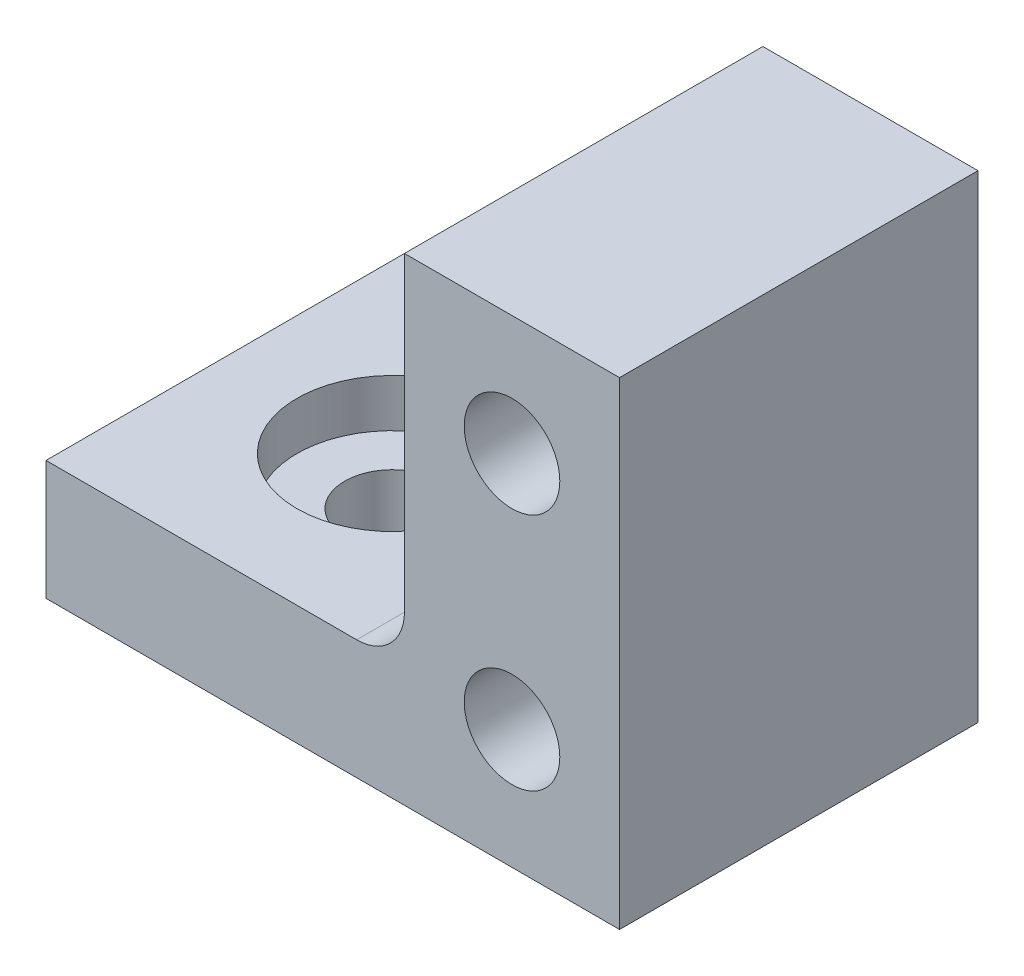
ISO-10303-21;
HEADER;
FILE_DESCRIPTION(('STEP AP214'),'2;1');
FILE_NAME('part.step','',(''),(''),'','','');
FILE_SCHEMA(('AUTOMOTIVE_DESIGN { 1 0 10303 214 1 1 1 1 }'));
ENDSEC;
DATA;
#1=APPLICATION_CONTEXT('core data for automotive mechanical design processes');
#2=APPLICATION_PROTOCOL_DEFINITION('international standard','automotive_design',2000,#1);
#3=PRODUCT_CONTEXT('',#1,'mechanical');
#4=PRODUCT('Part','Part','',(#3));
#5=PRODUCT_RELATED_PRODUCT_CATEGORY('part','',(#4));
#6=PRODUCT_DEFINITION_FORMATION('','',#4);
#7=PRODUCT_DEFINITION_CONTEXT('part definition',#1,'design');
#8=PRODUCT_DEFINITION('design','',#6,#7);
#9=PRODUCT_DEFINITION_SHAPE('','',#8);
#10=(LENGTH_UNIT() NAMED_UNIT(*) SI_UNIT(.MILLI.,.METRE.));
#11=(NAMED_UNIT(*) PLANE_ANGLE_UNIT() SI_UNIT($,.RADIAN.));
#12=(NAMED_UNIT(*) SI_UNIT($,.STERADIAN.) SOLID_ANGLE_UNIT());
#13=UNCERTAINTY_MEASURE_WITH_UNIT(LENGTH_MEASURE(1.E-05),#10,'distance_accuracy_value','');
#14=(GEOMETRIC_REPRESENTATION_CONTEXT(3) GLOBAL_UNCERTAINTY_ASSIGNED_CONTEXT((#13)) GLOBAL_UNIT_ASSIGNED_CONTEXT((#10,
#11,#12)) REPRESENTATION_CONTEXT('',''));
#15=CARTESIAN_POINT('',(0.,0.,0.));
#16=DIRECTION('',(0.,0.,1.));
#17=DIRECTION('',(1.,0.,0.));
#18=AXIS2_PLACEMENT_3D('',#15,#16,#17);
#19=CARTESIAN_POINT('',(-5.,-0.00100000000000013,0.));
#20=DIRECTION('',(0.,1.,0.));
#21=DIRECTION('',(0.,0.,1.));
#22=AXIS2_PLACEMENT_3D('',#19,#20,#21);
#23=CYLINDRICAL_SURFACE('',#22,2.);
#24=CARTESIAN_POINT('',(-5.,0.,0.));
#25=DIRECTION('',(0.,1.,0.));
#26=DIRECTION('',(0.,0.,1.));
#27=AXIS2_PLACEMENT_3D('',#24,#25,#26);
#28=CIRCLE('',#27,2.);
#29=CARTESIAN_POINT('',(-5.,0.,2.));
#30=VERTEX_POINT('',#29);
#31=EDGE_CURVE('E120',#30,#30,#28,.F.);
#32=ORIENTED_EDGE('',*,*,#31,.T.);
#33=EDGE_LOOP('',(#32));
#34=FACE_BOUND('',#33,.T.);
#35=CARTESIAN_POINT('',(-5.,3.,0.));
#36=DIRECTION('',(0.,1.,0.));
#37=DIRECTION('',(0.,0.,1.));
#38=AXIS2_PLACEMENT_3D('',#35,#36,#37);
#39=CIRCLE('',#38,2.);
#40=CARTESIAN_POINT('',(-5.,3.,2.));
#41=VERTEX_POINT('',#40);
#42=EDGE_CURVE('E123',#41,#41,#39,.F.);
#43=ORIENTED_EDGE('',*,*,#42,.F.);
#44=EDGE_LOOP('',(#43));
#45=FACE_BOUND('',#44,.T.);
#46=ADVANCED_FACE('F36',(#34,#45),#23,.F.);
#47=CARTESIAN_POINT('',(-12.,5.,-7.5));
#48=DIRECTION('',(1.,0.,0.));
#49=DIRECTION('',(0.,0.,-1.));
#50=AXIS2_PLACEMENT_3D('',#47,#48,#49);
#51=PLANE('',#50);
#52=DIRECTION('',(0.,0.,1.));
#53=VECTOR('',#52,1.);
#54=CARTESIAN_POINT('',(-12.,0.,-7.5));
#55=LINE('',#54,#53);
#56=CARTESIAN_POINT('',(-12.,0.,-7.5));
#57=VERTEX_POINT('',#56);
#58=CARTESIAN_POINT('',(-12.,0.,7.5));
#59=VERTEX_POINT('',#58);
#60=EDGE_CURVE('E132',#57,#59,#55,.T.);
#61=ORIENTED_EDGE('',*,*,#60,.T.);
#62=DIRECTION('',(0.,-1.,0.));
#63=VECTOR('',#62,1.);
#64=CARTESIAN_POINT('',(-12.,5.,7.5));
#65=LINE('',#64,#63);
#66=CARTESIAN_POINT('',(-12.,5.,7.5));
#67=VERTEX_POINT('',#66);
#68=EDGE_CURVE('E150',#67,#59,#65,.T.);
#69=ORIENTED_EDGE('',*,*,#68,.F.);
#70=DIRECTION('',(0.,0.,1.));
#71=VECTOR('',#70,1.);
#72=CARTESIAN_POINT('',(-12.,5.,-7.5));
#73=LINE('',#72,#71);
#74=CARTESIAN_POINT('',(-12.,5.,-7.5));
#75=VERTEX_POINT('',#74);
#76=EDGE_CURVE('E133',#75,#67,#73,.T.);
#77=ORIENTED_EDGE('',*,*,#76,.F.);
#78=DIRECTION('',(0.,-1.,0.));
#79=VECTOR('',#78,1.);
#80=CARTESIAN_POINT('',(-12.,5.,-7.5));
#81=LINE('',#80,#79);
#82=EDGE_CURVE('E105',#75,#57,#81,.T.);
#83=ORIENTED_EDGE('',*,*,#82,.T.);
#84=EDGE_LOOP('',(#61,#69,#77,#83));
#85=FACE_BOUND('',#84,.T.);
#86=ADVANCED_FACE('F172',(#85),#51,.F.);
#87=CARTESIAN_POINT('',(-12.,5.,7.5));
#88=DIRECTION('',(0.,0.,-1.));
#89=DIRECTION('',(-1.,0.,0.));
#90=AXIS2_PLACEMENT_3D('',#87,#88,#89);
#91=PLANE('',#90);
#92=CARTESIAN_POINT('',(7.5,15.,7.5));
#93=DIRECTION('',(0.,0.,1.));
#94=DIRECTION('',(1.,0.,0.));
#95=AXIS2_PLACEMENT_3D('',#92,#93,#94);
#96=CIRCLE('',#95,2.);
#97=CARTESIAN_POINT('',(9.5,15.,7.5));
#98=VERTEX_POINT('',#97);
#99=EDGE_CURVE('E311',#98,#98,#96,.T.);
#100=ORIENTED_EDGE('',*,*,#99,.F.);
#101=EDGE_LOOP('',(#100));
#102=FACE_BOUND('',#101,.T.);
#103=CARTESIAN_POINT('',(7.5,5.,7.5));
#104=DIRECTION('',(0.,0.,1.));
#105=DIRECTION('',(1.,0.,0.));
#106=AXIS2_PLACEMENT_3D('',#103,#104,#105);
#107=CIRCLE('',#106,2.);
#108=CARTESIAN_POINT('',(9.5,5.,7.5));
#109=VERTEX_POINT('',#108);
#110=EDGE_CURVE('E314',#109,#109,#107,.T.);
#111=ORIENTED_EDGE('',*,*,#110,.F.);
#112=EDGE_LOOP('',(#111));
#113=FACE_BOUND('',#112,.T.);
#114=DIRECTION('',(1.,0.,0.));
#115=VECTOR('',#114,1.);
#116=CARTESIAN_POINT('',(-12.,0.,7.5));
#117=LINE('',#116,#115);
#118=CARTESIAN_POINT('',(12.,0.,7.5));
#119=VERTEX_POINT('',#118);
#120=EDGE_CURVE('E143',#59,#119,#117,.T.);
#121=ORIENTED_EDGE('',*,*,#120,.T.);
#122=DIRECTION('',(0.,-1.,0.));
#123=VECTOR('',#122,1.);
#124=CARTESIAN_POINT('',(12.,5.,7.5));
#125=LINE('',#124,#123);
#126=CARTESIAN_POINT('',(12.,20.,7.5));
#127=VERTEX_POINT('',#126);
#128=EDGE_CURVE('E104',#127,#119,#125,.T.);
#129=ORIENTED_EDGE('',*,*,#128,.F.);
#130=DIRECTION('',(1.,0.,0.));
#131=VECTOR('',#130,1.);
#132=CARTESIAN_POINT('',(3.,20.,7.5));
#133=LINE('',#132,#131);
#134=CARTESIAN_POINT('',(3.,20.,7.5));
#135=VERTEX_POINT('',#134);
#136=EDGE_CURVE('E119',#135,#127,#133,.T.);
#137=ORIENTED_EDGE('',*,*,#136,.F.);
#138=DIRECTION('',(0.,-1.,0.));
#139=VECTOR('',#138,1.);
#140=CARTESIAN_POINT('',(3.,20.,7.5));
#141=LINE('',#140,#139);
#142=CARTESIAN_POINT('',(3.,7.,7.5));
#143=VERTEX_POINT('',#142);
#144=EDGE_CURVE('E129',#135,#143,#141,.T.);
#145=ORIENTED_EDGE('',*,*,#144,.T.);
#146=CARTESIAN_POINT('',(1.,7.,7.5));
#147=DIRECTION('',(0.,0.,-1.));
#148=DIRECTION('',(-1.,0.,0.));
#149=AXIS2_PLACEMENT_3D('',#146,#147,#148);
#150=CIRCLE('',#149,2.);
#151=CARTESIAN_POINT('',(1.,5.,7.5));
#152=VERTEX_POINT('',#151);
#153=EDGE_CURVE('E44',#143,#152,#150,.T.);
#154=ORIENTED_EDGE('',*,*,#153,.T.);
#155=DIRECTION('',(1.,0.,0.));
#156=VECTOR('',#155,1.);
#157=CARTESIAN_POINT('',(-12.,5.,7.5));
#158=LINE('',#157,#156);
#159=EDGE_CURVE('E136',#67,#152,#158,.T.);
#160=ORIENTED_EDGE('',*,*,#159,.F.);
#161=ORIENTED_EDGE('',*,*,#68,.T.);
#162=EDGE_LOOP('',(#121,#129,#137,#145,#154,#160,#161));
#163=FACE_BOUND('',#162,.T.);
#164=ADVANCED_FACE('F165',(#102,#113,#163),#91,.F.);
#165=CARTESIAN_POINT('',(12.,5.,-7.5));
#166=DIRECTION('',(1.,0.,0.));
#167=DIRECTION('',(0.,0.,-1.));
#168=AXIS2_PLACEMENT_3D('',#165,#166,#167);
#169=PLANE('',#168);
#170=DIRECTION('',(0.,0.,1.));
#171=VECTOR('',#170,1.);
#172=CARTESIAN_POINT('',(12.,0.,-7.5));
#173=LINE('',#172,#171);
#174=CARTESIAN_POINT('',(12.,0.,-7.5));
#175=VERTEX_POINT('',#174);
#176=EDGE_CURVE('E100',#175,#119,#173,.T.);
#177=ORIENTED_EDGE('',*,*,#176,.F.);
#178=DIRECTION('',(0.,-1.,0.));
#179=VECTOR('',#178,1.);
#180=CARTESIAN_POINT('',(12.,5.,-7.5));
#181=LINE('',#180,#179);
#182=CARTESIAN_POINT('',(12.,20.,-7.5));
#183=VERTEX_POINT('',#182);
#184=EDGE_CURVE('E94',#183,#175,#181,.T.);
#185=ORIENTED_EDGE('',*,*,#184,.F.);
#186=DIRECTION('',(0.,0.,-1.));
#187=VECTOR('',#186,1.);
#188=CARTESIAN_POINT('',(12.,20.,7.5));
#189=LINE('',#188,#187);
#190=EDGE_CURVE('E98',#127,#183,#189,.T.);
#191=ORIENTED_EDGE('',*,*,#190,.F.);
#192=ORIENTED_EDGE('',*,*,#128,.T.);
#193=EDGE_LOOP('',(#177,#185,#191,#192));
#194=FACE_BOUND('',#193,.T.);
#195=ADVANCED_FACE('F96',(#194),#169,.T.);
#196=CARTESIAN_POINT('',(-12.,5.,-7.5));
#197=DIRECTION('',(0.,0.,-1.));
#198=DIRECTION('',(-1.,0.,0.));
#199=AXIS2_PLACEMENT_3D('',#196,#197,#198);
#200=PLANE('',#199);
#201=CARTESIAN_POINT('',(7.5,15.,-7.5));
#202=DIRECTION('',(0.,0.,-1.));
#203=DIRECTION('',(-1.,0.,0.));
#204=AXIS2_PLACEMENT_3D('',#201,#202,#203);
#205=CIRCLE('',#204,2.);
#206=CARTESIAN_POINT('',(5.5,15.,-7.5));
#207=VERTEX_POINT('',#206);
#208=EDGE_CURVE('E319',#207,#207,#205,.F.);
#209=ORIENTED_EDGE('',*,*,#208,.T.);
#210=EDGE_LOOP('',(#209));
#211=FACE_BOUND('',#210,.T.);
#212=CARTESIAN_POINT('',(7.5,5.,-7.5));
#213=DIRECTION('',(0.,0.,-1.));
#214=DIRECTION('',(-1.,0.,0.));
#215=AXIS2_PLACEMENT_3D('',#212,#213,#214);
#216=CIRCLE('',#215,2.);
#217=CARTESIAN_POINT('',(5.5,5.,-7.5));
#218=VERTEX_POINT('',#217);
#219=EDGE_CURVE('E316',#218,#218,#216,.F.);
#220=ORIENTED_EDGE('',*,*,#219,.T.);
#221=EDGE_LOOP('',(#220));
#222=FACE_BOUND('',#221,.T.);
#223=DIRECTION('',(1.,0.,0.));
#224=VECTOR('',#223,1.);
#225=CARTESIAN_POINT('',(-12.,0.,-7.5));
#226=LINE('',#225,#224);
#227=EDGE_CURVE('E137',#57,#175,#226,.T.);
#228=ORIENTED_EDGE('',*,*,#227,.F.);
#229=ORIENTED_EDGE('',*,*,#82,.F.);
#230=DIRECTION('',(1.,0.,0.));
#231=VECTOR('',#230,1.);
#232=CARTESIAN_POINT('',(-12.,5.,-7.5));
#233=LINE('',#232,#231);
#234=CARTESIAN_POINT('',(0.999999999999999,5.,-7.5));
#235=VERTEX_POINT('',#234);
#236=EDGE_CURVE('E139',#75,#235,#233,.T.);
#237=ORIENTED_EDGE('',*,*,#236,.T.);
#238=CARTESIAN_POINT('',(0.999999999999999,7.,-7.5));
#239=DIRECTION('',(0.,0.,-1.));
#240=DIRECTION('',(-1.,0.,0.));
#241=AXIS2_PLACEMENT_3D('',#238,#239,#240);
#242=CIRCLE('',#241,2.);
#243=CARTESIAN_POINT('',(3.,7.,-7.5));
#244=VERTEX_POINT('',#243);
#245=EDGE_CURVE('E11',#235,#244,#242,.F.);
#246=ORIENTED_EDGE('',*,*,#245,.T.);
#247=DIRECTION('',(0.,-1.,0.));
#248=VECTOR('',#247,1.);
#249=CARTESIAN_POINT('',(3.,20.,-7.5));
#250=LINE('',#249,#248);
#251=CARTESIAN_POINT('',(3.,20.,-7.5));
#252=VERTEX_POINT('',#251);
#253=EDGE_CURVE('E111',#252,#244,#250,.T.);
#254=ORIENTED_EDGE('',*,*,#253,.F.);
#255=DIRECTION('',(-1.,0.,0.));
#256=VECTOR('',#255,1.);
#257=CARTESIAN_POINT('',(12.,20.,-7.5));
#258=LINE('',#257,#256);
#259=EDGE_CURVE('E108',#183,#252,#258,.T.);
#260=ORIENTED_EDGE('',*,*,#259,.F.);
#261=ORIENTED_EDGE('',*,*,#184,.T.);
#262=EDGE_LOOP('',(#228,#229,#237,#246,#254,#260,#261));
#263=FACE_BOUND('',#262,.T.);
#264=ADVANCED_FACE('F109',(#211,#222,#263),#200,.T.);
#265=CARTESIAN_POINT('',(0.,5.,0.));
#266=DIRECTION('',(0.,1.,0.));
#267=DIRECTION('',(0.,0.,1.));
#268=AXIS2_PLACEMENT_3D('',#265,#266,#267);
#269=PLANE('',#268);
#270=CARTESIAN_POINT('',(-5.,5.,0.));
#271=DIRECTION('',(0.,1.,0.));
#272=DIRECTION('',(0.,0.,1.));
#273=AXIS2_PLACEMENT_3D('',#270,#271,#272);
#274=CIRCLE('',#273,4.);
#275=CARTESIAN_POINT('',(-5.,5.,4.));
#276=VERTEX_POINT('',#275);
#277=EDGE_CURVE('E324',#276,#276,#274,.T.);
#278=ORIENTED_EDGE('',*,*,#277,.F.);
#279=EDGE_LOOP('',(#278));
#280=FACE_BOUND('',#279,.T.);
#281=ORIENTED_EDGE('',*,*,#159,.T.);
#282=DIRECTION('',(0.,0.,1.));
#283=VECTOR('',#282,1.);
#284=CARTESIAN_POINT('',(1.,5.,0.));
#285=LINE('',#284,#283);
#286=EDGE_CURVE('E57',#152,#235,#285,.F.);
#287=ORIENTED_EDGE('',*,*,#286,.T.);
#288=ORIENTED_EDGE('',*,*,#236,.F.);
#289=ORIENTED_EDGE('',*,*,#76,.T.);
#290=EDGE_LOOP('',(#281,#287,#288,#289));
#291=FACE_BOUND('',#290,.T.);
#292=ADVANCED_FACE('F173',(#280,#291),#269,.T.);
#293=CARTESIAN_POINT('',(0.,0.,0.));
#294=DIRECTION('',(0.,1.,0.));
#295=DIRECTION('',(0.,0.,1.));
#296=AXIS2_PLACEMENT_3D('',#293,#294,#295);
#297=PLANE('',#296);
#298=ORIENTED_EDGE('',*,*,#31,.F.);
#299=EDGE_LOOP('',(#298));
#300=FACE_BOUND('',#299,.T.);
#301=ORIENTED_EDGE('',*,*,#60,.F.);
#302=ORIENTED_EDGE('',*,*,#227,.T.);
#303=ORIENTED_EDGE('',*,*,#176,.T.);
#304=ORIENTED_EDGE('',*,*,#120,.F.);
#305=EDGE_LOOP('',(#301,#302,#303,#304));
#306=FACE_BOUND('',#305,.T.);
#307=ADVANCED_FACE('F169',(#300,#306),#297,.F.);
#308=CARTESIAN_POINT('',(3.,20.,-7.5));
#309=DIRECTION('',(1.,0.,0.));
#310=DIRECTION('',(0.,0.,-1.));
#311=AXIS2_PLACEMENT_3D('',#308,#309,#310);
#312=PLANE('',#311);
#313=ORIENTED_EDGE('',*,*,#253,.T.);
#314=DIRECTION('',(0.,0.,1.));
#315=VECTOR('',#314,1.);
#316=CARTESIAN_POINT('',(3.,7.,-7.5));
#317=LINE('',#316,#315);
#318=EDGE_CURVE('E153',#244,#143,#317,.T.);
#319=ORIENTED_EDGE('',*,*,#318,.T.);
#320=ORIENTED_EDGE('',*,*,#144,.F.);
#321=DIRECTION('',(0.,0.,1.));
#322=VECTOR('',#321,1.);
#323=CARTESIAN_POINT('',(3.,20.,-7.5));
#324=LINE('',#323,#322);
#325=EDGE_CURVE('E114',#252,#135,#324,.T.);
#326=ORIENTED_EDGE('',*,*,#325,.F.);
#327=EDGE_LOOP('',(#313,#319,#320,#326));
#328=FACE_BOUND('',#327,.T.);
#329=ADVANCED_FACE('F162',(#328),#312,.F.);
#330=CARTESIAN_POINT('',(0.,20.,0.));
#331=DIRECTION('',(0.,1.,0.));
#332=DIRECTION('',(0.,0.,1.));
#333=AXIS2_PLACEMENT_3D('',#330,#331,#332);
#334=PLANE('',#333);
#335=ORIENTED_EDGE('',*,*,#190,.T.);
#336=ORIENTED_EDGE('',*,*,#259,.T.);
#337=ORIENTED_EDGE('',*,*,#325,.T.);
#338=ORIENTED_EDGE('',*,*,#136,.T.);
#339=EDGE_LOOP('',(#335,#336,#337,#338));
#340=FACE_BOUND('',#339,.T.);
#341=ADVANCED_FACE('F117',(#340),#334,.T.);
#342=CARTESIAN_POINT('',(-5.,3.,0.));
#343=DIRECTION('',(0.,1.,0.));
#344=DIRECTION('',(0.,0.,1.));
#345=AXIS2_PLACEMENT_3D('',#342,#343,#344);
#346=PLANE('',#345);
#347=CARTESIAN_POINT('',(-5.,3.,0.));
#348=DIRECTION('',(0.,1.,0.));
#349=DIRECTION('',(0.,0.,1.));
#350=AXIS2_PLACEMENT_3D('',#347,#348,#349);
#351=CIRCLE('',#350,4.);
#352=CARTESIAN_POINT('',(-5.,3.,4.));
#353=VERTEX_POINT('',#352);
#354=EDGE_CURVE('E156',#353,#353,#351,.T.);
#355=ORIENTED_EDGE('',*,*,#354,.T.);
#356=EDGE_LOOP('',(#355));
#357=FACE_BOUND('',#356,.T.);
#358=ORIENTED_EDGE('',*,*,#42,.T.);
#359=EDGE_LOOP('',(#358));
#360=FACE_BOUND('',#359,.T.);
#361=ADVANCED_FACE('F199',(#357,#360),#346,.T.);
#362=CARTESIAN_POINT('',(-5.,3.,0.));
#363=DIRECTION('',(0.,1.,0.));
#364=DIRECTION('',(0.,0.,1.));
#365=AXIS2_PLACEMENT_3D('',#362,#363,#364);
#366=CYLINDRICAL_SURFACE('',#365,4.);
#367=ORIENTED_EDGE('',*,*,#354,.F.);
#368=EDGE_LOOP('',(#367));
#369=FACE_BOUND('',#368,.T.);
#370=ORIENTED_EDGE('',*,*,#277,.T.);
#371=EDGE_LOOP('',(#370));
#372=FACE_BOUND('',#371,.T.);
#373=ADVANCED_FACE('F196',(#369,#372),#366,.F.);
#374=CARTESIAN_POINT('',(7.5,5.,-7.501));
#375=DIRECTION('',(0.,0.,1.));
#376=DIRECTION('',(1.,0.,0.));
#377=AXIS2_PLACEMENT_3D('',#374,#375,#376);
#378=CYLINDRICAL_SURFACE('',#377,2.);
#379=ORIENTED_EDGE('',*,*,#219,.F.);
#380=EDGE_LOOP('',(#379));
#381=FACE_BOUND('',#380,.T.);
#382=ORIENTED_EDGE('',*,*,#110,.T.);
#383=EDGE_LOOP('',(#382));
#384=FACE_BOUND('',#383,.T.);
#385=ADVANCED_FACE('F223',(#381,#384),#378,.F.);
#386=CARTESIAN_POINT('',(7.5,15.,-7.501));
#387=DIRECTION('',(0.,0.,1.));
#388=DIRECTION('',(1.,0.,0.));
#389=AXIS2_PLACEMENT_3D('',#386,#387,#388);
#390=CYLINDRICAL_SURFACE('',#389,2.);
#391=ORIENTED_EDGE('',*,*,#208,.F.);
#392=EDGE_LOOP('',(#391));
#393=FACE_BOUND('',#392,.T.);
#394=ORIENTED_EDGE('',*,*,#99,.T.);
#395=EDGE_LOOP('',(#394));
#396=FACE_BOUND('',#395,.T.);
#397=ADVANCED_FACE('F230',(#393,#396),#390,.F.);
#398=CARTESIAN_POINT('',(0.999999999999999,7.,-7.5));
#399=DIRECTION('',(0.,0.,1.));
#400=DIRECTION('',(1.,0.,0.));
#401=AXIS2_PLACEMENT_3D('',#398,#399,#400);
#402=CYLINDRICAL_SURFACE('',#401,2.);
#403=ORIENTED_EDGE('',*,*,#245,.F.);
#404=ORIENTED_EDGE('',*,*,#286,.F.);
#405=ORIENTED_EDGE('',*,*,#153,.F.);
#406=ORIENTED_EDGE('',*,*,#318,.F.);
#407=EDGE_LOOP('',(#403,#404,#405,#406));
#408=FACE_BOUND('',#407,.T.);
#409=ADVANCED_FACE('F38',(#408),#402,.F.);
#410=CLOSED_SHELL('',(#46,#86,#164,#195,#264,#292,#307,#329,#341,#361,#373,#385,#397,#409));
#411=MANIFOLD_SOLID_BREP('B2',#410);
#412=ADVANCED_BREP_SHAPE_REPRESENTATION('',(#18,#411),#14);
#413=SHAPE_DEFINITION_REPRESENTATION(#9,#412);
ENDSEC;
END-ISO-10303-21;
